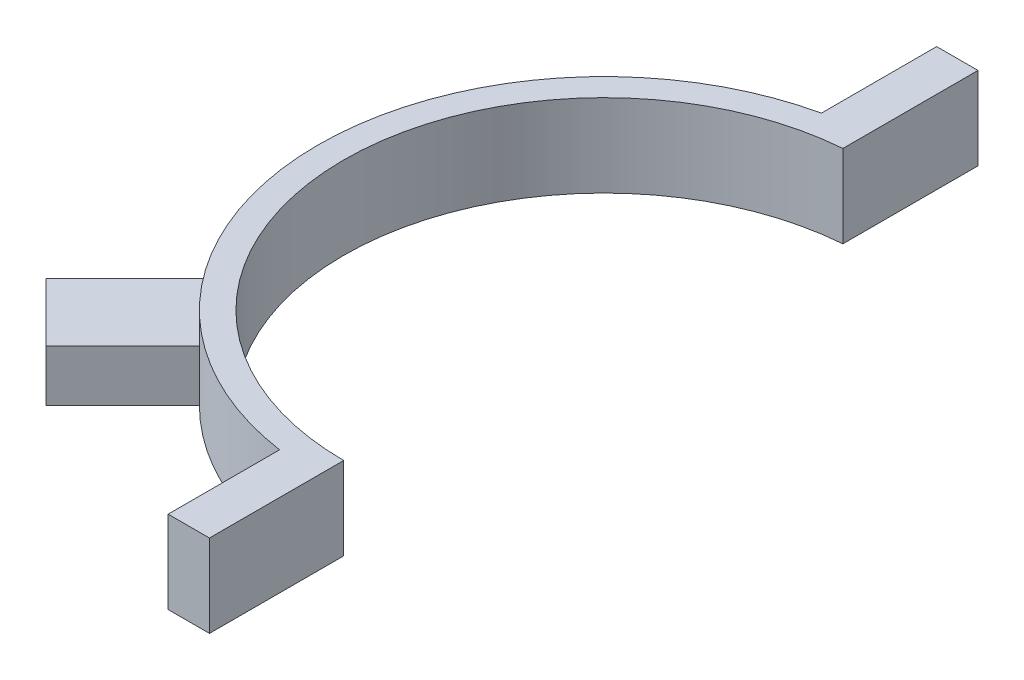
ISO-10303-21;
HEADER;
FILE_DESCRIPTION(('STEP AP214'),'2;1');
FILE_NAME('part.step','',(''),(''),'','','');
FILE_SCHEMA(('AUTOMOTIVE_DESIGN { 1 0 10303 214 1 1 1 1 }'));
ENDSEC;
DATA;
#1=APPLICATION_CONTEXT('core data for automotive mechanical design processes');
#2=APPLICATION_PROTOCOL_DEFINITION('international standard','automotive_design',2000,#1);
#3=PRODUCT_CONTEXT('',#1,'mechanical');
#4=PRODUCT('Part','Part','',(#3));
#5=PRODUCT_RELATED_PRODUCT_CATEGORY('part','',(#4));
#6=PRODUCT_DEFINITION_FORMATION('','',#4);
#7=PRODUCT_DEFINITION_CONTEXT('part definition',#1,'design');
#8=PRODUCT_DEFINITION('design','',#6,#7);
#9=PRODUCT_DEFINITION_SHAPE('','',#8);
#10=(LENGTH_UNIT() NAMED_UNIT(*) SI_UNIT(.MILLI.,.METRE.));
#11=(NAMED_UNIT(*) PLANE_ANGLE_UNIT() SI_UNIT($,.RADIAN.));
#12=(NAMED_UNIT(*) SI_UNIT($,.STERADIAN.) SOLID_ANGLE_UNIT());
#13=UNCERTAINTY_MEASURE_WITH_UNIT(LENGTH_MEASURE(1.E-05),#10,'distance_accuracy_value','');
#14=(GEOMETRIC_REPRESENTATION_CONTEXT(3) GLOBAL_UNCERTAINTY_ASSIGNED_CONTEXT((#13)) GLOBAL_UNIT_ASSIGNED_CONTEXT((#10,
#11,#12)) REPRESENTATION_CONTEXT('',''));
#15=CARTESIAN_POINT('',(0.,0.,0.));
#16=DIRECTION('',(0.,0.,1.));
#17=DIRECTION('',(1.,0.,0.));
#18=AXIS2_PLACEMENT_3D('',#15,#16,#17);
#19=CARTESIAN_POINT('',(0.,10.16,0.));
#20=DIRECTION('',(0.,-1.,0.));
#21=DIRECTION('',(0.,0.,-1.));
#22=AXIS2_PLACEMENT_3D('',#19,#20,#21);
#23=CYLINDRICAL_SURFACE('',#22,32.004);
#24=CARTESIAN_POINT('',(0.,0.,0.));
#25=DIRECTION('',(0.,-1.,0.));
#26=DIRECTION('',(0.,0.,1.));
#27=AXIS2_PLACEMENT_3D('',#24,#25,#26);
#28=CIRCLE('',#27,32.004);
#29=CARTESIAN_POINT('',(0.,0.,32.004));
#30=VERTEX_POINT('',#29);
#31=CARTESIAN_POINT('',(-2.54,0.,-31.9030471271946));
#32=VERTEX_POINT('',#31);
#33=EDGE_CURVE('E195',#30,#32,#28,.T.);
#34=ORIENTED_EDGE('',*,*,#33,.T.);
#35=DIRECTION('',(0.,-1.,0.));
#36=VECTOR('',#35,1.);
#37=CARTESIAN_POINT('',(-2.54,10.16,-31.9030471271946));
#38=LINE('',#37,#36);
#39=CARTESIAN_POINT('',(-2.54,10.16,-31.9030471271946));
#40=VERTEX_POINT('',#39);
#41=EDGE_CURVE('E42',#40,#32,#38,.T.);
#42=ORIENTED_EDGE('',*,*,#41,.F.);
#43=CARTESIAN_POINT('',(0.,10.16,0.));
#44=DIRECTION('',(0.,-1.,0.));
#45=DIRECTION('',(0.,0.,1.));
#46=AXIS2_PLACEMENT_3D('',#43,#44,#45);
#47=CIRCLE('',#46,32.004);
#48=CARTESIAN_POINT('',(0.,10.16,32.004));
#49=VERTEX_POINT('',#48);
#50=EDGE_CURVE('E196',#49,#40,#47,.T.);
#51=ORIENTED_EDGE('',*,*,#50,.F.);
#52=DIRECTION('',(0.,-1.,0.));
#53=VECTOR('',#52,1.);
#54=CARTESIAN_POINT('',(0.,10.16,32.004));
#55=LINE('',#54,#53);
#56=EDGE_CURVE('E206',#49,#30,#55,.T.);
#57=ORIENTED_EDGE('',*,*,#56,.T.);
#58=EDGE_LOOP('',(#34,#42,#51,#57));
#59=FACE_BOUND('',#58,.T.);
#60=ADVANCED_FACE('F35',(#59),#23,.F.);
#61=CARTESIAN_POINT('',(-2.54,10.16,-31.9030471271946));
#62=DIRECTION('',(-1.,0.,0.));
#63=DIRECTION('',(0.,0.,1.));
#64=AXIS2_PLACEMENT_3D('',#61,#62,#63);
#65=PLANE('',#64);
#66=DIRECTION('',(0.,0.,-1.));
#67=VECTOR('',#66,1.);
#68=CARTESIAN_POINT('',(-2.54,0.,-31.9030471271946));
#69=LINE('',#68,#67);
#70=CARTESIAN_POINT('',(-2.53999999999994,0.,-48.514));
#71=VERTEX_POINT('',#70);
#72=EDGE_CURVE('E208',#32,#71,#69,.T.);
#73=ORIENTED_EDGE('',*,*,#72,.T.);
#74=DIRECTION('',(0.,1.,0.));
#75=VECTOR('',#74,1.);
#76=CARTESIAN_POINT('',(-2.53999999999994,10.16,-48.514));
#77=LINE('',#76,#75);
#78=CARTESIAN_POINT('',(-2.53999999999994,10.16,-48.514));
#79=VERTEX_POINT('',#78);
#80=EDGE_CURVE('E157',#71,#79,#77,.T.);
#81=ORIENTED_EDGE('',*,*,#80,.T.);
#82=DIRECTION('',(0.,0.,-1.));
#83=VECTOR('',#82,1.);
#84=CARTESIAN_POINT('',(-2.54,10.16,-31.9030471271946));
#85=LINE('',#84,#83);
#86=EDGE_CURVE('E199',#40,#79,#85,.T.);
#87=ORIENTED_EDGE('',*,*,#86,.F.);
#88=ORIENTED_EDGE('',*,*,#41,.T.);
#89=EDGE_LOOP('',(#73,#81,#87,#88));
#90=FACE_BOUND('',#89,.T.);
#91=ADVANCED_FACE('F218',(#90),#65,.F.);
#92=CARTESIAN_POINT('',(0.,10.16,0.));
#93=DIRECTION('',(0.,-1.,0.));
#94=DIRECTION('',(0.,0.,-1.));
#95=AXIS2_PLACEMENT_3D('',#92,#93,#94);
#96=CYLINDRICAL_SURFACE('',#95,35.179);
#97=CARTESIAN_POINT('',(0.,6.35,0.));
#98=DIRECTION('',(0.,-1.,0.));
#99=DIRECTION('',(0.,0.,-1.));
#100=AXIS2_PLACEMENT_3D('',#97,#98,#99);
#101=CIRCLE('',#100,35.179);
#102=CARTESIAN_POINT('',(-24.8753094553616,6.35,24.8753094553615));
#103=VERTEX_POINT('',#102);
#104=CARTESIAN_POINT('',(-30.9994987329599,6.35,16.6310889392492));
#105=VERTEX_POINT('',#104);
#106=EDGE_CURVE('E11',#103,#105,#101,.T.);
#107=ORIENTED_EDGE('',*,*,#106,.F.);
#108=DIRECTION('',(0.,-1.,0.));
#109=VECTOR('',#108,1.);
#110=CARTESIAN_POINT('',(-24.8753094553616,10.16,24.8753094553615));
#111=LINE('',#110,#109);
#112=CARTESIAN_POINT('',(-24.8753094553616,0.,24.8753094553615));
#113=VERTEX_POINT('',#112);
#114=EDGE_CURVE('E152',#103,#113,#111,.T.);
#115=ORIENTED_EDGE('',*,*,#114,.T.);
#116=CARTESIAN_POINT('',(0.,0.,0.));
#117=DIRECTION('',(0.,1.,0.));
#118=DIRECTION('',(0.,0.,1.));
#119=AXIS2_PLACEMENT_3D('',#116,#117,#118);
#120=CIRCLE('',#119,35.179);
#121=CARTESIAN_POINT('',(-5.08,0.,34.8102806797073));
#122=VERTEX_POINT('',#121);
#123=EDGE_CURVE('E210',#113,#122,#120,.T.);
#124=ORIENTED_EDGE('',*,*,#123,.T.);
#125=DIRECTION('',(0.,-1.,0.));
#126=VECTOR('',#125,1.);
#127=CARTESIAN_POINT('',(-5.08,10.16,34.8102806797073));
#128=LINE('',#127,#126);
#129=CARTESIAN_POINT('',(-5.08,10.16,34.8102806797073));
#130=VERTEX_POINT('',#129);
#131=EDGE_CURVE('E190',#122,#130,#128,.F.);
#132=ORIENTED_EDGE('',*,*,#131,.T.);
#133=CARTESIAN_POINT('',(0.,10.16,0.));
#134=DIRECTION('',(0.,1.,0.));
#135=DIRECTION('',(0.,0.,1.));
#136=AXIS2_PLACEMENT_3D('',#133,#134,#135);
#137=CIRCLE('',#136,35.179);
#138=CARTESIAN_POINT('',(-7.61999999999999,10.16,-34.3438151782821));
#139=VERTEX_POINT('',#138);
#140=EDGE_CURVE('E202',#139,#130,#137,.T.);
#141=ORIENTED_EDGE('',*,*,#140,.F.);
#142=DIRECTION('',(0.,-1.,0.));
#143=VECTOR('',#142,1.);
#144=CARTESIAN_POINT('',(-7.61999999999999,10.16,-34.3438151782821));
#145=LINE('',#144,#143);
#146=CARTESIAN_POINT('',(-7.61999999999999,0.,-34.3438151782821));
#147=VERTEX_POINT('',#146);
#148=EDGE_CURVE('E170',#139,#147,#145,.T.);
#149=ORIENTED_EDGE('',*,*,#148,.T.);
#150=CARTESIAN_POINT('',(-30.9994987329599,0.,16.6310889392492));
#151=VERTEX_POINT('',#150);
#152=EDGE_CURVE('E211',#147,#151,#120,.T.);
#153=ORIENTED_EDGE('',*,*,#152,.T.);
#154=DIRECTION('',(0.,-1.,0.));
#155=VECTOR('',#154,1.);
#156=CARTESIAN_POINT('',(-30.9994987329599,10.16,16.6310889392492));
#157=LINE('',#156,#155);
#158=EDGE_CURVE('E49',#151,#105,#157,.F.);
#159=ORIENTED_EDGE('',*,*,#158,.T.);
#160=EDGE_LOOP('',(#107,#115,#124,#132,#141,#149,#153,#159));
#161=FACE_BOUND('',#160,.T.);
#162=ADVANCED_FACE('F250',(#161),#96,.T.);
#163=CARTESIAN_POINT('',(0.,10.16,32.004));
#164=DIRECTION('',(-1.,0.,0.));
#165=DIRECTION('',(0.,0.,1.));
#166=AXIS2_PLACEMENT_3D('',#163,#164,#165);
#167=PLANE('',#166);
#168=DIRECTION('',(0.,0.,-1.));
#169=VECTOR('',#168,1.);
#170=CARTESIAN_POINT('',(0.,0.,32.004));
#171=LINE('',#170,#169);
#172=CARTESIAN_POINT('',(0.,0.,48.514));
#173=VERTEX_POINT('',#172);
#174=EDGE_CURVE('E200',#173,#30,#171,.T.);
#175=ORIENTED_EDGE('',*,*,#174,.T.);
#176=ORIENTED_EDGE('',*,*,#56,.F.);
#177=DIRECTION('',(0.,0.,-1.));
#178=VECTOR('',#177,1.);
#179=CARTESIAN_POINT('',(0.,10.16,32.004));
#180=LINE('',#179,#178);
#181=CARTESIAN_POINT('',(0.,10.16,48.514));
#182=VERTEX_POINT('',#181);
#183=EDGE_CURVE('E204',#182,#49,#180,.T.);
#184=ORIENTED_EDGE('',*,*,#183,.F.);
#185=DIRECTION('',(0.,-1.,0.));
#186=VECTOR('',#185,1.);
#187=CARTESIAN_POINT('',(0.,10.16,48.514));
#188=LINE('',#187,#186);
#189=EDGE_CURVE('E183',#182,#173,#188,.T.);
#190=ORIENTED_EDGE('',*,*,#189,.T.);
#191=EDGE_LOOP('',(#175,#176,#184,#190));
#192=FACE_BOUND('',#191,.T.);
#193=ADVANCED_FACE('F241',(#192),#167,.F.);
#194=CARTESIAN_POINT('',(0.,10.16,0.));
#195=DIRECTION('',(0.,1.,0.));
#196=DIRECTION('',(0.,0.,1.));
#197=AXIS2_PLACEMENT_3D('',#194,#195,#196);
#198=PLANE('',#197);
#199=ORIENTED_EDGE('',*,*,#86,.T.);
#200=DIRECTION('',(-1.,0.,0.));
#201=VECTOR('',#200,1.);
#202=CARTESIAN_POINT('',(-2.53999999999994,10.16,-48.514));
#203=LINE('',#202,#201);
#204=CARTESIAN_POINT('',(-7.61999999999994,10.16,-48.514));
#205=VERTEX_POINT('',#204);
#206=EDGE_CURVE('E160',#79,#205,#203,.T.);
#207=ORIENTED_EDGE('',*,*,#206,.T.);
#208=DIRECTION('',(0.,0.,1.));
#209=VECTOR('',#208,1.);
#210=CARTESIAN_POINT('',(-7.61999999999994,10.16,-48.514));
#211=LINE('',#210,#209);
#212=EDGE_CURVE('E166',#205,#139,#211,.T.);
#213=ORIENTED_EDGE('',*,*,#212,.T.);
#214=ORIENTED_EDGE('',*,*,#140,.T.);
#215=DIRECTION('',(0.,0.,-1.));
#216=VECTOR('',#215,1.);
#217=CARTESIAN_POINT('',(-5.08000000000005,10.16,48.514));
#218=LINE('',#217,#216);
#219=CARTESIAN_POINT('',(-5.08000000000005,10.16,48.514));
#220=VERTEX_POINT('',#219);
#221=EDGE_CURVE('E187',#220,#130,#218,.T.);
#222=ORIENTED_EDGE('',*,*,#221,.F.);
#223=DIRECTION('',(1.,0.,0.));
#224=VECTOR('',#223,1.);
#225=CARTESIAN_POINT('',(-5.08000000000005,10.16,48.514));
#226=LINE('',#225,#224);
#227=EDGE_CURVE('E180',#220,#182,#226,.T.);
#228=ORIENTED_EDGE('',*,*,#227,.T.);
#229=ORIENTED_EDGE('',*,*,#183,.T.);
#230=ORIENTED_EDGE('',*,*,#50,.T.);
#231=EDGE_LOOP('',(#199,#207,#213,#214,#222,#228,#229,#230));
#232=FACE_BOUND('',#231,.T.);
#233=ADVANCED_FACE('F237',(#232),#198,.T.);
#234=CARTESIAN_POINT('',(0.,0.,0.));
#235=DIRECTION('',(0.,1.,0.));
#236=DIRECTION('',(0.,0.,1.));
#237=AXIS2_PLACEMENT_3D('',#234,#235,#236);
#238=PLANE('',#237);
#239=ORIENTED_EDGE('',*,*,#123,.F.);
#240=DIRECTION('',(-0.707106781186549,0.,0.707106781186546));
#241=VECTOR('',#240,1.);
#242=CARTESIAN_POINT('',(-22.6302454250943,0.,22.6302454250942));
#243=LINE('',#242,#241);
#244=CARTESIAN_POINT('',(-34.3045783824842,0.,34.3045783824841));
#245=VERTEX_POINT('',#244);
#246=EDGE_CURVE('E142',#113,#245,#243,.T.);
#247=ORIENTED_EDGE('',*,*,#246,.T.);
#248=DIRECTION('',(-0.707106781186547,0.,-0.707106781186548));
#249=VECTOR('',#248,1.);
#250=CARTESIAN_POINT('',(-34.3045783824842,0.,34.3045783824841));
#251=LINE('',#250,#249);
#252=CARTESIAN_POINT('',(-41.4887832793395,0.,27.1203734856288));
#253=VERTEX_POINT('',#252);
#254=EDGE_CURVE('E147',#245,#253,#251,.T.);
#255=ORIENTED_EDGE('',*,*,#254,.T.);
#256=DIRECTION('',(0.707106781186549,0.,-0.707106781186546));
#257=VECTOR('',#256,1.);
#258=CARTESIAN_POINT('',(-41.4887832793395,0.,27.1203734856288));
#259=LINE('',#258,#257);
#260=EDGE_CURVE('E125',#253,#151,#259,.T.);
#261=ORIENTED_EDGE('',*,*,#260,.T.);
#262=ORIENTED_EDGE('',*,*,#152,.F.);
#263=DIRECTION('',(0.,0.,1.));
#264=VECTOR('',#263,1.);
#265=CARTESIAN_POINT('',(-7.61999999999994,0.,-48.514));
#266=LINE('',#265,#264);
#267=CARTESIAN_POINT('',(-7.61999999999994,0.,-48.514));
#268=VERTEX_POINT('',#267);
#269=EDGE_CURVE('E167',#268,#147,#266,.T.);
#270=ORIENTED_EDGE('',*,*,#269,.F.);
#271=DIRECTION('',(1.,0.,0.));
#272=VECTOR('',#271,1.);
#273=CARTESIAN_POINT('',(-2.53999999999994,0.,-48.514));
#274=LINE('',#273,#272);
#275=EDGE_CURVE('E154',#268,#71,#274,.T.);
#276=ORIENTED_EDGE('',*,*,#275,.T.);
#277=ORIENTED_EDGE('',*,*,#72,.F.);
#278=ORIENTED_EDGE('',*,*,#33,.F.);
#279=ORIENTED_EDGE('',*,*,#174,.F.);
#280=DIRECTION('',(-1.,0.,0.));
#281=VECTOR('',#280,1.);
#282=CARTESIAN_POINT('',(-5.08000000000005,0.,48.514));
#283=LINE('',#282,#281);
#284=CARTESIAN_POINT('',(-5.08000000000005,0.,48.514));
#285=VERTEX_POINT('',#284);
#286=EDGE_CURVE('E174',#173,#285,#283,.T.);
#287=ORIENTED_EDGE('',*,*,#286,.T.);
#288=DIRECTION('',(0.,0.,-1.));
#289=VECTOR('',#288,1.);
#290=CARTESIAN_POINT('',(-5.08000000000005,0.,48.514));
#291=LINE('',#290,#289);
#292=EDGE_CURVE('E186',#285,#122,#291,.T.);
#293=ORIENTED_EDGE('',*,*,#292,.T.);
#294=EDGE_LOOP('',(#239,#247,#255,#261,#262,#270,#276,#277,#278,#279,#287,#293));
#295=FACE_BOUND('',#294,.T.);
#296=ADVANCED_FACE('F226',(#295),#238,.F.);
#297=CARTESIAN_POINT('',(-5.08000000000005,10.16,48.514));
#298=DIRECTION('',(-1.,0.,0.));
#299=DIRECTION('',(0.,0.,1.));
#300=AXIS2_PLACEMENT_3D('',#297,#298,#299);
#301=PLANE('',#300);
#302=ORIENTED_EDGE('',*,*,#131,.F.);
#303=ORIENTED_EDGE('',*,*,#292,.F.);
#304=DIRECTION('',(0.,1.,0.));
#305=VECTOR('',#304,1.);
#306=CARTESIAN_POINT('',(-5.08000000000005,10.16,48.514));
#307=LINE('',#306,#305);
#308=EDGE_CURVE('E177',#285,#220,#307,.T.);
#309=ORIENTED_EDGE('',*,*,#308,.T.);
#310=ORIENTED_EDGE('',*,*,#221,.T.);
#311=EDGE_LOOP('',(#302,#303,#309,#310));
#312=FACE_BOUND('',#311,.T.);
#313=ADVANCED_FACE('F248',(#312),#301,.T.);
#314=CARTESIAN_POINT('',(-1.43052528228139E-13,0.,48.514));
#315=DIRECTION('',(0.,0.,-1.));
#316=DIRECTION('',(-1.,0.,0.));
#317=AXIS2_PLACEMENT_3D('',#314,#315,#316);
#318=PLANE('',#317);
#319=ORIENTED_EDGE('',*,*,#286,.F.);
#320=ORIENTED_EDGE('',*,*,#189,.F.);
#321=ORIENTED_EDGE('',*,*,#227,.F.);
#322=ORIENTED_EDGE('',*,*,#308,.F.);
#323=EDGE_LOOP('',(#319,#320,#321,#322));
#324=FACE_BOUND('',#323,.T.);
#325=ADVANCED_FACE('F245',(#324),#318,.F.);
#326=CARTESIAN_POINT('',(-7.61999999999994,10.16,-48.514));
#327=DIRECTION('',(-1.,0.,0.));
#328=DIRECTION('',(0.,0.,1.));
#329=AXIS2_PLACEMENT_3D('',#326,#327,#328);
#330=PLANE('',#329);
#331=ORIENTED_EDGE('',*,*,#148,.F.);
#332=ORIENTED_EDGE('',*,*,#212,.F.);
#333=DIRECTION('',(0.,-1.,0.));
#334=VECTOR('',#333,1.);
#335=CARTESIAN_POINT('',(-7.61999999999994,10.16,-48.514));
#336=LINE('',#335,#334);
#337=EDGE_CURVE('E163',#205,#268,#336,.T.);
#338=ORIENTED_EDGE('',*,*,#337,.T.);
#339=ORIENTED_EDGE('',*,*,#269,.T.);
#340=EDGE_LOOP('',(#331,#332,#338,#339));
#341=FACE_BOUND('',#340,.T.);
#342=ADVANCED_FACE('F235',(#341),#330,.T.);
#343=CARTESIAN_POINT('',(1.88789451688147E-13,0.,-48.514));
#344=DIRECTION('',(0.,0.,1.));
#345=DIRECTION('',(1.,0.,0.));
#346=AXIS2_PLACEMENT_3D('',#343,#344,#345);
#347=PLANE('',#346);
#348=ORIENTED_EDGE('',*,*,#275,.F.);
#349=ORIENTED_EDGE('',*,*,#337,.F.);
#350=ORIENTED_EDGE('',*,*,#206,.F.);
#351=ORIENTED_EDGE('',*,*,#80,.F.);
#352=EDGE_LOOP('',(#348,#349,#350,#351));
#353=FACE_BOUND('',#352,.T.);
#354=ADVANCED_FACE('F231',(#353),#347,.F.);
#355=CARTESIAN_POINT('',(-22.6302454250943,6.35,22.6302454250942));
#356=DIRECTION('',(0.707106781186546,0.,0.707106781186549));
#357=DIRECTION('',(0.707106781186549,0.,-0.707106781186546));
#358=AXIS2_PLACEMENT_3D('',#355,#356,#357);
#359=PLANE('',#358);
#360=ORIENTED_EDGE('',*,*,#114,.F.);
#361=DIRECTION('',(-0.707106781186549,0.,0.707106781186546));
#362=VECTOR('',#361,1.);
#363=CARTESIAN_POINT('',(-22.6302454250943,6.35,22.6302454250942));
#364=LINE('',#363,#362);
#365=CARTESIAN_POINT('',(-34.3045783824842,6.35,34.3045783824841));
#366=VERTEX_POINT('',#365);
#367=EDGE_CURVE('E131',#103,#366,#364,.T.);
#368=ORIENTED_EDGE('',*,*,#367,.T.);
#369=DIRECTION('',(0.,-1.,0.));
#370=VECTOR('',#369,1.);
#371=CARTESIAN_POINT('',(-34.3045783824842,6.35,34.3045783824841));
#372=LINE('',#371,#370);
#373=EDGE_CURVE('E130',#366,#245,#372,.T.);
#374=ORIENTED_EDGE('',*,*,#373,.T.);
#375=ORIENTED_EDGE('',*,*,#246,.F.);
#376=EDGE_LOOP('',(#360,#368,#374,#375));
#377=FACE_BOUND('',#376,.T.);
#378=ADVANCED_FACE('F252',(#377),#359,.T.);
#379=CARTESIAN_POINT('',(-41.4887832793395,6.35,27.1203734856288));
#380=DIRECTION('',(-0.707106781186546,0.,-0.707106781186549));
#381=DIRECTION('',(-0.707106781186549,0.,0.707106781186546));
#382=AXIS2_PLACEMENT_3D('',#379,#380,#381);
#383=PLANE('',#382);
#384=ORIENTED_EDGE('',*,*,#158,.F.);
#385=ORIENTED_EDGE('',*,*,#260,.F.);
#386=DIRECTION('',(0.,-1.,0.));
#387=VECTOR('',#386,1.);
#388=CARTESIAN_POINT('',(-41.4887832793395,6.35,27.1203734856288));
#389=LINE('',#388,#387);
#390=CARTESIAN_POINT('',(-41.4887832793395,6.35,27.1203734856288));
#391=VERTEX_POINT('',#390);
#392=EDGE_CURVE('E120',#391,#253,#389,.T.);
#393=ORIENTED_EDGE('',*,*,#392,.F.);
#394=DIRECTION('',(0.707106781186549,0.,-0.707106781186546));
#395=VECTOR('',#394,1.);
#396=CARTESIAN_POINT('',(-41.4887832793395,6.35,27.1203734856288));
#397=LINE('',#396,#395);
#398=EDGE_CURVE('E123',#391,#105,#397,.T.);
#399=ORIENTED_EDGE('',*,*,#398,.T.);
#400=EDGE_LOOP('',(#384,#385,#393,#399));
#401=FACE_BOUND('',#400,.T.);
#402=ADVANCED_FACE('F122',(#401),#383,.T.);
#403=CARTESIAN_POINT('',(-34.3045783824842,6.35,34.3045783824841));
#404=DIRECTION('',(-0.707106781186548,0.,0.707106781186547));
#405=DIRECTION('',(0.707106781186547,0.,0.707106781186548));
#406=AXIS2_PLACEMENT_3D('',#403,#404,#405);
#407=PLANE('',#406);
#408=ORIENTED_EDGE('',*,*,#254,.F.);
#409=ORIENTED_EDGE('',*,*,#373,.F.);
#410=DIRECTION('',(-0.707106781186547,0.,-0.707106781186548));
#411=VECTOR('',#410,1.);
#412=CARTESIAN_POINT('',(-34.3045783824842,6.35,34.3045783824841));
#413=LINE('',#412,#411);
#414=EDGE_CURVE('E137',#366,#391,#413,.T.);
#415=ORIENTED_EDGE('',*,*,#414,.T.);
#416=ORIENTED_EDGE('',*,*,#392,.T.);
#417=EDGE_LOOP('',(#408,#409,#415,#416));
#418=FACE_BOUND('',#417,.T.);
#419=ADVANCED_FACE('F140',(#418),#407,.T.);
#420=CARTESIAN_POINT('',(0.,6.35,0.));
#421=DIRECTION('',(0.,-1.,0.));
#422=DIRECTION('',(0.,0.,-1.));
#423=AXIS2_PLACEMENT_3D('',#420,#421,#422);
#424=PLANE('',#423);
#425=ORIENTED_EDGE('',*,*,#367,.F.);
#426=ORIENTED_EDGE('',*,*,#106,.T.);
#427=ORIENTED_EDGE('',*,*,#398,.F.);
#428=ORIENTED_EDGE('',*,*,#414,.F.);
#429=EDGE_LOOP('',(#425,#426,#427,#428));
#430=FACE_BOUND('',#429,.T.);
#431=ADVANCED_FACE('F136',(#430),#424,.F.);
#432=CLOSED_SHELL('',(#60,#91,#162,#193,#233,#296,#313,#325,#342,#354,#378,#402,#419,#431));
#433=MANIFOLD_SOLID_BREP('B2',#432);
#434=ADVANCED_BREP_SHAPE_REPRESENTATION('',(#18,#433),#14);
#435=SHAPE_DEFINITION_REPRESENTATION(#9,#434);
ENDSEC;
END-ISO-10303-21;
